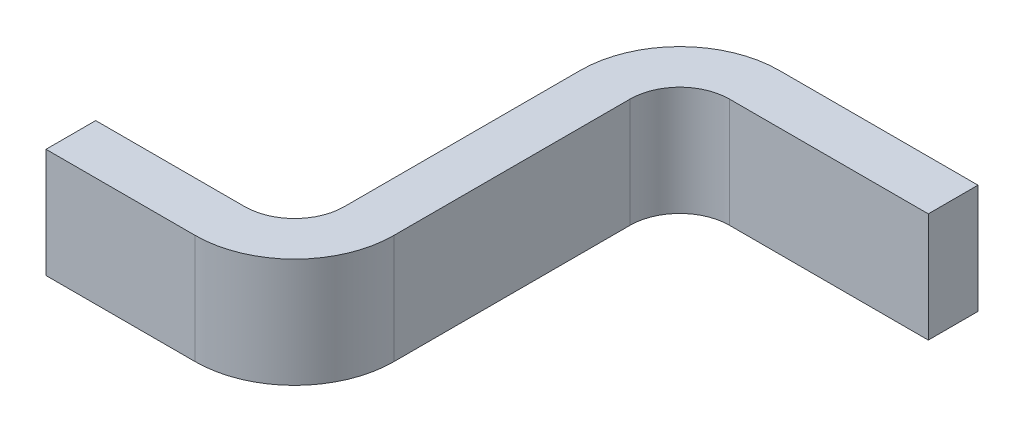
ISO-10303-21;
HEADER;
FILE_DESCRIPTION(('STEP AP214'),'2;1');
FILE_NAME('part.step','',(''),(''),'','','');
FILE_SCHEMA(('AUTOMOTIVE_DESIGN { 1 0 10303 214 1 1 1 1 }'));
ENDSEC;
DATA;
#1=APPLICATION_CONTEXT('core data for automotive mechanical design processes');
#2=APPLICATION_PROTOCOL_DEFINITION('international standard','automotive_design',2000,#1);
#3=PRODUCT_CONTEXT('',#1,'mechanical');
#4=PRODUCT('Part','Part','',(#3));
#5=PRODUCT_RELATED_PRODUCT_CATEGORY('part','',(#4));
#6=PRODUCT_DEFINITION_FORMATION('','',#4);
#7=PRODUCT_DEFINITION_CONTEXT('part definition',#1,'design');
#8=PRODUCT_DEFINITION('design','',#6,#7);
#9=PRODUCT_DEFINITION_SHAPE('','',#8);
#10=(LENGTH_UNIT() NAMED_UNIT(*) SI_UNIT(.MILLI.,.METRE.));
#11=(NAMED_UNIT(*) PLANE_ANGLE_UNIT() SI_UNIT($,.RADIAN.));
#12=(NAMED_UNIT(*) SI_UNIT($,.STERADIAN.) SOLID_ANGLE_UNIT());
#13=UNCERTAINTY_MEASURE_WITH_UNIT(LENGTH_MEASURE(1.E-05),#10,'distance_accuracy_value','');
#14=(GEOMETRIC_REPRESENTATION_CONTEXT(3) GLOBAL_UNCERTAINTY_ASSIGNED_CONTEXT((#13)) GLOBAL_UNIT_ASSIGNED_CONTEXT((#10,
#11,#12)) REPRESENTATION_CONTEXT('',''));
#15=CARTESIAN_POINT('',(0.,0.,0.));
#16=DIRECTION('',(0.,0.,1.));
#17=DIRECTION('',(1.,0.,0.));
#18=AXIS2_PLACEMENT_3D('',#15,#16,#17);
#19=CARTESIAN_POINT('',(3.9,1.86,0.675));
#20=DIRECTION('',(0.,-1.,0.));
#21=DIRECTION('',(0.,0.,-1.));
#22=AXIS2_PLACEMENT_3D('',#19,#20,#21);
#23=PLANE('',#22);
#24=CARTESIAN_POINT('',(3.8,1.86,0.675));
#25=DIRECTION('',(0.,-1.,0.));
#26=DIRECTION('',(0.,0.,-1.));
#27=AXIS2_PLACEMENT_3D('',#24,#25,#26);
#28=CIRCLE('',#27,0.1);
#29=CARTESIAN_POINT('',(3.9,1.86,0.675));
#30=VERTEX_POINT('',#29);
#31=CARTESIAN_POINT('',(3.8,1.86,0.775));
#32=VERTEX_POINT('',#31);
#33=EDGE_CURVE('E162',#30,#32,#28,.T.);
#34=ORIENTED_EDGE('',*,*,#33,.T.);
#35=DIRECTION('',(1.,0.,0.));
#36=VECTOR('',#35,1.);
#37=CARTESIAN_POINT('',(3.50000000000001,1.86,0.775));
#38=LINE('',#37,#36);
#39=CARTESIAN_POINT('',(3.50000000000001,1.86,0.775));
#40=VERTEX_POINT('',#39);
#41=EDGE_CURVE('E120',#32,#40,#38,.F.);
#42=ORIENTED_EDGE('',*,*,#41,.T.);
#43=DIRECTION('',(0.,0.,1.));
#44=VECTOR('',#43,1.);
#45=CARTESIAN_POINT('',(3.50000000000001,1.86,0.775));
#46=LINE('',#45,#44);
#47=CARTESIAN_POINT('',(3.50000000000001,1.86,0.875));
#48=VERTEX_POINT('',#47);
#49=EDGE_CURVE('E116',#48,#40,#46,.F.);
#50=ORIENTED_EDGE('',*,*,#49,.F.);
#51=DIRECTION('',(-1.,0.,0.));
#52=VECTOR('',#51,1.);
#53=CARTESIAN_POINT('',(3.50000000000001,1.86,0.875));
#54=LINE('',#53,#52);
#55=CARTESIAN_POINT('',(3.8,1.86,0.875));
#56=VERTEX_POINT('',#55);
#57=EDGE_CURVE('E111',#48,#56,#54,.F.);
#58=ORIENTED_EDGE('',*,*,#57,.T.);
#59=CARTESIAN_POINT('',(3.8,1.86,0.675));
#60=DIRECTION('',(0.,-1.,0.));
#61=DIRECTION('',(0.,0.,-1.));
#62=AXIS2_PLACEMENT_3D('',#59,#60,#61);
#63=CIRCLE('',#62,0.2);
#64=CARTESIAN_POINT('',(4.,1.86,0.675));
#65=VERTEX_POINT('',#64);
#66=EDGE_CURVE('E102',#65,#56,#63,.T.);
#67=ORIENTED_EDGE('',*,*,#66,.F.);
#68=DIRECTION('',(0.,0.,1.));
#69=VECTOR('',#68,1.);
#70=CARTESIAN_POINT('',(4.,1.86,0.675));
#71=LINE('',#70,#69);
#72=CARTESIAN_POINT('',(4.,1.86,0.2));
#73=VERTEX_POINT('',#72);
#74=EDGE_CURVE('E98',#65,#73,#71,.F.);
#75=ORIENTED_EDGE('',*,*,#74,.T.);
#76=CARTESIAN_POINT('',(4.1,1.86,0.2));
#77=DIRECTION('',(0.,1.,0.));
#78=DIRECTION('',(0.,0.,1.));
#79=AXIS2_PLACEMENT_3D('',#76,#77,#78);
#80=CIRCLE('',#79,0.1);
#81=CARTESIAN_POINT('',(4.1,1.86,0.1));
#82=VERTEX_POINT('',#81);
#83=EDGE_CURVE('E20',#73,#82,#80,.F.);
#84=ORIENTED_EDGE('',*,*,#83,.T.);
#85=DIRECTION('',(-1.,0.,0.));
#86=VECTOR('',#85,1.);
#87=CARTESIAN_POINT('',(4.1,1.86,0.1));
#88=LINE('',#87,#86);
#89=CARTESIAN_POINT('',(4.5,1.86,0.1));
#90=VERTEX_POINT('',#89);
#91=EDGE_CURVE('E145',#82,#90,#88,.F.);
#92=ORIENTED_EDGE('',*,*,#91,.T.);
#93=DIRECTION('',(0.,0.,1.));
#94=VECTOR('',#93,1.);
#95=CARTESIAN_POINT('',(4.5,1.86,0.));
#96=LINE('',#95,#94);
#97=CARTESIAN_POINT('',(4.5,1.86,0.));
#98=VERTEX_POINT('',#97);
#99=EDGE_CURVE('E139',#90,#98,#96,.F.);
#100=ORIENTED_EDGE('',*,*,#99,.T.);
#101=DIRECTION('',(1.,0.,0.));
#102=VECTOR('',#101,1.);
#103=CARTESIAN_POINT('',(4.1,1.86,0.));
#104=LINE('',#103,#102);
#105=CARTESIAN_POINT('',(4.1,1.86,0.));
#106=VERTEX_POINT('',#105);
#107=EDGE_CURVE('E132',#98,#106,#104,.F.);
#108=ORIENTED_EDGE('',*,*,#107,.T.);
#109=CARTESIAN_POINT('',(4.1,1.86,0.2));
#110=DIRECTION('',(0.,1.,0.));
#111=DIRECTION('',(0.,0.,1.));
#112=AXIS2_PLACEMENT_3D('',#109,#110,#111);
#113=CIRCLE('',#112,0.2);
#114=CARTESIAN_POINT('',(3.9,1.86,0.2));
#115=VERTEX_POINT('',#114);
#116=EDGE_CURVE('E135',#115,#106,#113,.F.);
#117=ORIENTED_EDGE('',*,*,#116,.F.);
#118=DIRECTION('',(0.,0.,-1.));
#119=VECTOR('',#118,1.);
#120=CARTESIAN_POINT('',(3.9,1.86,0.675));
#121=LINE('',#120,#119);
#122=EDGE_CURVE('E128',#115,#30,#121,.F.);
#123=ORIENTED_EDGE('',*,*,#122,.T.);
#124=EDGE_LOOP('',(#34,#42,#50,#58,#67,#75,#84,#92,#100,#108,#117,#123));
#125=FACE_BOUND('',#124,.T.);
#126=ADVANCED_FACE('F17',(#125),#23,.F.);
#127=CARTESIAN_POINT('',(4.1,1.86,0.2));
#128=DIRECTION('',(0.,1.,0.));
#129=DIRECTION('',(0.,0.,1.));
#130=AXIS2_PLACEMENT_3D('',#127,#128,#129);
#131=CYLINDRICAL_SURFACE('',#130,0.1);
#132=DIRECTION('',(0.,1.,0.));
#133=VECTOR('',#132,1.);
#134=CARTESIAN_POINT('',(4.,1.86,0.2));
#135=LINE('',#134,#133);
#136=CARTESIAN_POINT('',(4.,1.64,0.2));
#137=VERTEX_POINT('',#136);
#138=EDGE_CURVE('E91',#73,#137,#135,.F.);
#139=ORIENTED_EDGE('',*,*,#138,.T.);
#140=CARTESIAN_POINT('',(4.1,1.64,0.2));
#141=DIRECTION('',(0.,1.,0.));
#142=DIRECTION('',(0.,0.,1.));
#143=AXIS2_PLACEMENT_3D('',#140,#141,#142);
#144=CIRCLE('',#143,0.1);
#145=CARTESIAN_POINT('',(4.1,1.64,0.1));
#146=VERTEX_POINT('',#145);
#147=EDGE_CURVE('E103',#137,#146,#144,.F.);
#148=ORIENTED_EDGE('',*,*,#147,.T.);
#149=DIRECTION('',(0.,1.,0.));
#150=VECTOR('',#149,1.);
#151=CARTESIAN_POINT('',(4.1,1.86,0.1));
#152=LINE('',#151,#150);
#153=EDGE_CURVE('E92',#146,#82,#152,.T.);
#154=ORIENTED_EDGE('',*,*,#153,.T.);
#155=ORIENTED_EDGE('',*,*,#83,.F.);
#156=EDGE_LOOP('',(#139,#148,#154,#155));
#157=FACE_BOUND('',#156,.T.);
#158=ADVANCED_FACE('F89',(#157),#131,.F.);
#159=CARTESIAN_POINT('',(4.1,1.86,0.1));
#160=DIRECTION('',(0.,0.,-1.));
#161=DIRECTION('',(-1.,0.,0.));
#162=AXIS2_PLACEMENT_3D('',#159,#160,#161);
#163=PLANE('',#162);
#164=ORIENTED_EDGE('',*,*,#153,.F.);
#165=DIRECTION('',(1.,0.,0.));
#166=VECTOR('',#165,1.);
#167=CARTESIAN_POINT('',(4.,1.64,0.1));
#168=LINE('',#167,#166);
#169=CARTESIAN_POINT('',(4.5,1.64,0.1));
#170=VERTEX_POINT('',#169);
#171=EDGE_CURVE('E105',#146,#170,#168,.T.);
#172=ORIENTED_EDGE('',*,*,#171,.T.);
#173=DIRECTION('',(0.,1.,0.));
#174=VECTOR('',#173,1.);
#175=CARTESIAN_POINT('',(4.5,1.64,0.1));
#176=LINE('',#175,#174);
#177=EDGE_CURVE('E142',#170,#90,#176,.T.);
#178=ORIENTED_EDGE('',*,*,#177,.T.);
#179=ORIENTED_EDGE('',*,*,#91,.F.);
#180=EDGE_LOOP('',(#164,#172,#178,#179));
#181=FACE_BOUND('',#180,.T.);
#182=ADVANCED_FACE('F187',(#181),#163,.F.);
#183=CARTESIAN_POINT('',(4.5,1.64,0.));
#184=DIRECTION('',(-1.,0.,0.));
#185=DIRECTION('',(0.,0.,1.));
#186=AXIS2_PLACEMENT_3D('',#183,#184,#185);
#187=PLANE('',#186);
#188=ORIENTED_EDGE('',*,*,#177,.F.);
#189=DIRECTION('',(0.,0.,1.));
#190=VECTOR('',#189,1.);
#191=CARTESIAN_POINT('',(4.5,1.64,0.675));
#192=LINE('',#191,#190);
#193=CARTESIAN_POINT('',(4.5,1.64,0.));
#194=VERTEX_POINT('',#193);
#195=EDGE_CURVE('E176',#170,#194,#192,.F.);
#196=ORIENTED_EDGE('',*,*,#195,.T.);
#197=DIRECTION('',(0.,1.,0.));
#198=VECTOR('',#197,1.);
#199=CARTESIAN_POINT('',(4.5,1.64,0.));
#200=LINE('',#199,#198);
#201=EDGE_CURVE('E136',#194,#98,#200,.T.);
#202=ORIENTED_EDGE('',*,*,#201,.T.);
#203=ORIENTED_EDGE('',*,*,#99,.F.);
#204=EDGE_LOOP('',(#188,#196,#202,#203));
#205=FACE_BOUND('',#204,.T.);
#206=ADVANCED_FACE('F192',(#205),#187,.F.);
#207=CARTESIAN_POINT('',(4.1,1.64,0.));
#208=DIRECTION('',(0.,0.,1.));
#209=DIRECTION('',(1.,0.,0.));
#210=AXIS2_PLACEMENT_3D('',#207,#208,#209);
#211=PLANE('',#210);
#212=DIRECTION('',(0.,1.,0.));
#213=VECTOR('',#212,1.);
#214=CARTESIAN_POINT('',(4.1,1.64,0.));
#215=LINE('',#214,#213);
#216=CARTESIAN_POINT('',(4.1,1.64,0.));
#217=VERTEX_POINT('',#216);
#218=EDGE_CURVE('E163',#106,#217,#215,.F.);
#219=ORIENTED_EDGE('',*,*,#218,.F.);
#220=ORIENTED_EDGE('',*,*,#107,.F.);
#221=ORIENTED_EDGE('',*,*,#201,.F.);
#222=DIRECTION('',(1.,0.,0.));
#223=VECTOR('',#222,1.);
#224=CARTESIAN_POINT('',(4.,1.64,0.));
#225=LINE('',#224,#223);
#226=EDGE_CURVE('E159',#194,#217,#225,.F.);
#227=ORIENTED_EDGE('',*,*,#226,.T.);
#228=EDGE_LOOP('',(#219,#220,#221,#227));
#229=FACE_BOUND('',#228,.T.);
#230=ADVANCED_FACE('F264',(#229),#211,.F.);
#231=CARTESIAN_POINT('',(4.1,1.64,0.2));
#232=DIRECTION('',(0.,1.,0.));
#233=DIRECTION('',(0.,0.,1.));
#234=AXIS2_PLACEMENT_3D('',#231,#232,#233);
#235=CYLINDRICAL_SURFACE('',#234,0.2);
#236=ORIENTED_EDGE('',*,*,#116,.T.);
#237=ORIENTED_EDGE('',*,*,#218,.T.);
#238=CARTESIAN_POINT('',(4.1,1.64,0.2));
#239=DIRECTION('',(0.,1.,0.));
#240=DIRECTION('',(0.,0.,1.));
#241=AXIS2_PLACEMENT_3D('',#238,#239,#240);
#242=CIRCLE('',#241,0.2);
#243=CARTESIAN_POINT('',(3.90000000000001,1.64,0.2));
#244=VERTEX_POINT('',#243);
#245=EDGE_CURVE('E157',#217,#244,#242,.T.);
#246=ORIENTED_EDGE('',*,*,#245,.T.);
#247=DIRECTION('',(0.,1.,0.));
#248=VECTOR('',#247,1.);
#249=CARTESIAN_POINT('',(3.90000000000001,1.64,0.2));
#250=LINE('',#249,#248);
#251=EDGE_CURVE('E131',#244,#115,#250,.T.);
#252=ORIENTED_EDGE('',*,*,#251,.T.);
#253=EDGE_LOOP('',(#236,#237,#246,#252));
#254=FACE_BOUND('',#253,.T.);
#255=ADVANCED_FACE('F266',(#254),#235,.T.);
#256=CARTESIAN_POINT('',(3.90000000000001,1.64,0.675));
#257=DIRECTION('',(1.,0.,0.));
#258=DIRECTION('',(0.,0.,-1.));
#259=AXIS2_PLACEMENT_3D('',#256,#257,#258);
#260=PLANE('',#259);
#261=DIRECTION('',(0.,-1.,0.));
#262=VECTOR('',#261,1.);
#263=CARTESIAN_POINT('',(3.90000000000001,1.64,0.675));
#264=LINE('',#263,#262);
#265=CARTESIAN_POINT('',(3.90000000000001,1.64,0.675));
#266=VERTEX_POINT('',#265);
#267=EDGE_CURVE('E130',#266,#30,#264,.F.);
#268=ORIENTED_EDGE('',*,*,#267,.T.);
#269=ORIENTED_EDGE('',*,*,#122,.F.);
#270=ORIENTED_EDGE('',*,*,#251,.F.);
#271=DIRECTION('',(0.,0.,1.));
#272=VECTOR('',#271,1.);
#273=CARTESIAN_POINT('',(3.90000000000001,1.64,0.675));
#274=LINE('',#273,#272);
#275=EDGE_CURVE('E156',#244,#266,#274,.T.);
#276=ORIENTED_EDGE('',*,*,#275,.T.);
#277=EDGE_LOOP('',(#268,#269,#270,#276));
#278=FACE_BOUND('',#277,.T.);
#279=ADVANCED_FACE('F231',(#278),#260,.F.);
#280=CARTESIAN_POINT('',(3.8,1.64,0.675));
#281=DIRECTION('',(0.,-1.,0.));
#282=DIRECTION('',(0.,0.,-1.));
#283=AXIS2_PLACEMENT_3D('',#280,#281,#282);
#284=CYLINDRICAL_SURFACE('',#283,0.1);
#285=DIRECTION('',(0.,1.,0.));
#286=VECTOR('',#285,1.);
#287=CARTESIAN_POINT('',(3.8,1.64,0.775));
#288=LINE('',#287,#286);
#289=CARTESIAN_POINT('',(3.8,1.64,0.775));
#290=VERTEX_POINT('',#289);
#291=EDGE_CURVE('E125',#290,#32,#288,.T.);
#292=ORIENTED_EDGE('',*,*,#291,.T.);
#293=ORIENTED_EDGE('',*,*,#33,.F.);
#294=ORIENTED_EDGE('',*,*,#267,.F.);
#295=CARTESIAN_POINT('',(3.8,1.64,0.675));
#296=DIRECTION('',(0.,-1.,0.));
#297=DIRECTION('',(0.,0.,-1.));
#298=AXIS2_PLACEMENT_3D('',#295,#296,#297);
#299=CIRCLE('',#298,0.1);
#300=EDGE_CURVE('E152',#266,#290,#299,.T.);
#301=ORIENTED_EDGE('',*,*,#300,.T.);
#302=EDGE_LOOP('',(#292,#293,#294,#301));
#303=FACE_BOUND('',#302,.T.);
#304=ADVANCED_FACE('F235',(#303),#284,.F.);
#305=CARTESIAN_POINT('',(3.50000000000001,1.64,0.775));
#306=DIRECTION('',(0.,0.,1.));
#307=DIRECTION('',(1.,0.,0.));
#308=AXIS2_PLACEMENT_3D('',#305,#306,#307);
#309=PLANE('',#308);
#310=DIRECTION('',(0.,1.,0.));
#311=VECTOR('',#310,1.);
#312=CARTESIAN_POINT('',(3.50000000000001,1.64,0.775));
#313=LINE('',#312,#311);
#314=CARTESIAN_POINT('',(3.50000000000001,1.64,0.775));
#315=VERTEX_POINT('',#314);
#316=EDGE_CURVE('E119',#40,#315,#313,.F.);
#317=ORIENTED_EDGE('',*,*,#316,.F.);
#318=ORIENTED_EDGE('',*,*,#41,.F.);
#319=ORIENTED_EDGE('',*,*,#291,.F.);
#320=DIRECTION('',(1.,0.,0.));
#321=VECTOR('',#320,1.);
#322=CARTESIAN_POINT('',(4.,1.64,0.775));
#323=LINE('',#322,#321);
#324=EDGE_CURVE('E155',#290,#315,#323,.F.);
#325=ORIENTED_EDGE('',*,*,#324,.T.);
#326=EDGE_LOOP('',(#317,#318,#319,#325));
#327=FACE_BOUND('',#326,.T.);
#328=ADVANCED_FACE('F259',(#327),#309,.F.);
#329=CARTESIAN_POINT('',(3.50000000000001,1.64,0.775));
#330=DIRECTION('',(-1.,0.,0.));
#331=DIRECTION('',(0.,0.,1.));
#332=AXIS2_PLACEMENT_3D('',#329,#330,#331);
#333=PLANE('',#332);
#334=DIRECTION('',(0.,0.,1.));
#335=VECTOR('',#334,1.);
#336=CARTESIAN_POINT('',(3.50000000000001,1.64,0.675));
#337=LINE('',#336,#335);
#338=CARTESIAN_POINT('',(3.50000000000001,1.64,0.875));
#339=VERTEX_POINT('',#338);
#340=EDGE_CURVE('E217',#315,#339,#337,.T.);
#341=ORIENTED_EDGE('',*,*,#340,.T.);
#342=DIRECTION('',(0.,1.,0.));
#343=VECTOR('',#342,1.);
#344=CARTESIAN_POINT('',(3.50000000000001,1.86,0.875));
#345=LINE('',#344,#343);
#346=EDGE_CURVE('E113',#339,#48,#345,.T.);
#347=ORIENTED_EDGE('',*,*,#346,.T.);
#348=ORIENTED_EDGE('',*,*,#49,.T.);
#349=ORIENTED_EDGE('',*,*,#316,.T.);
#350=EDGE_LOOP('',(#341,#347,#348,#349));
#351=FACE_BOUND('',#350,.T.);
#352=ADVANCED_FACE('F255',(#351),#333,.T.);
#353=CARTESIAN_POINT('',(3.50000000000001,1.86,0.875));
#354=DIRECTION('',(0.,0.,-1.));
#355=DIRECTION('',(-1.,0.,0.));
#356=AXIS2_PLACEMENT_3D('',#353,#354,#355);
#357=PLANE('',#356);
#358=ORIENTED_EDGE('',*,*,#346,.F.);
#359=DIRECTION('',(1.,0.,0.));
#360=VECTOR('',#359,1.);
#361=CARTESIAN_POINT('',(4.,1.64,0.875));
#362=LINE('',#361,#360);
#363=CARTESIAN_POINT('',(3.8,1.64,0.875));
#364=VERTEX_POINT('',#363);
#365=EDGE_CURVE('E151',#339,#364,#362,.T.);
#366=ORIENTED_EDGE('',*,*,#365,.T.);
#367=DIRECTION('',(0.,-1.,0.));
#368=VECTOR('',#367,1.);
#369=CARTESIAN_POINT('',(3.8,1.86,0.875));
#370=LINE('',#369,#368);
#371=EDGE_CURVE('E99',#56,#364,#370,.T.);
#372=ORIENTED_EDGE('',*,*,#371,.F.);
#373=ORIENTED_EDGE('',*,*,#57,.F.);
#374=EDGE_LOOP('',(#358,#366,#372,#373));
#375=FACE_BOUND('',#374,.T.);
#376=ADVANCED_FACE('F251',(#375),#357,.F.);
#377=CARTESIAN_POINT('',(3.8,1.86,0.675));
#378=DIRECTION('',(0.,-1.,0.));
#379=DIRECTION('',(0.,0.,-1.));
#380=AXIS2_PLACEMENT_3D('',#377,#378,#379);
#381=CYLINDRICAL_SURFACE('',#380,0.2);
#382=CARTESIAN_POINT('',(3.8,1.64,0.675));
#383=DIRECTION('',(0.,-1.,0.));
#384=DIRECTION('',(0.,0.,-1.));
#385=AXIS2_PLACEMENT_3D('',#382,#383,#384);
#386=CIRCLE('',#385,0.2);
#387=CARTESIAN_POINT('',(4.,1.64,0.675));
#388=VERTEX_POINT('',#387);
#389=EDGE_CURVE('E26',#364,#388,#386,.F.);
#390=ORIENTED_EDGE('',*,*,#389,.T.);
#391=DIRECTION('',(0.,1.,0.));
#392=VECTOR('',#391,1.);
#393=CARTESIAN_POINT('',(4.,1.86,0.675));
#394=LINE('',#393,#392);
#395=EDGE_CURVE('E34',#388,#65,#394,.T.);
#396=ORIENTED_EDGE('',*,*,#395,.T.);
#397=ORIENTED_EDGE('',*,*,#66,.T.);
#398=ORIENTED_EDGE('',*,*,#371,.T.);
#399=EDGE_LOOP('',(#390,#396,#397,#398));
#400=FACE_BOUND('',#399,.T.);
#401=ADVANCED_FACE('F280',(#400),#381,.T.);
#402=CARTESIAN_POINT('',(4.,1.86,0.675));
#403=DIRECTION('',(-1.,0.,0.));
#404=DIRECTION('',(0.,0.,1.));
#405=AXIS2_PLACEMENT_3D('',#402,#403,#404);
#406=PLANE('',#405);
#407=ORIENTED_EDGE('',*,*,#395,.F.);
#408=DIRECTION('',(0.,0.,1.));
#409=VECTOR('',#408,1.);
#410=CARTESIAN_POINT('',(4.,1.64,0.675));
#411=LINE('',#410,#409);
#412=EDGE_CURVE('E11',#388,#137,#411,.F.);
#413=ORIENTED_EDGE('',*,*,#412,.T.);
#414=ORIENTED_EDGE('',*,*,#138,.F.);
#415=ORIENTED_EDGE('',*,*,#74,.F.);
#416=EDGE_LOOP('',(#407,#413,#414,#415));
#417=FACE_BOUND('',#416,.T.);
#418=ADVANCED_FACE('F97',(#417),#406,.F.);
#419=CARTESIAN_POINT('',(4.,1.64,0.675));
#420=DIRECTION('',(0.,1.,0.));
#421=DIRECTION('',(0.,0.,1.));
#422=AXIS2_PLACEMENT_3D('',#419,#420,#421);
#423=PLANE('',#422);
#424=ORIENTED_EDGE('',*,*,#389,.F.);
#425=ORIENTED_EDGE('',*,*,#365,.F.);
#426=ORIENTED_EDGE('',*,*,#340,.F.);
#427=ORIENTED_EDGE('',*,*,#324,.F.);
#428=ORIENTED_EDGE('',*,*,#300,.F.);
#429=ORIENTED_EDGE('',*,*,#275,.F.);
#430=ORIENTED_EDGE('',*,*,#245,.F.);
#431=ORIENTED_EDGE('',*,*,#226,.F.);
#432=ORIENTED_EDGE('',*,*,#195,.F.);
#433=ORIENTED_EDGE('',*,*,#171,.F.);
#434=ORIENTED_EDGE('',*,*,#147,.F.);
#435=ORIENTED_EDGE('',*,*,#412,.F.);
#436=EDGE_LOOP('',(#424,#425,#426,#427,#428,#429,#430,#431,#432,#433,#434,#435));
#437=FACE_BOUND('',#436,.T.);
#438=ADVANCED_FACE('F197',(#437),#423,.F.);
#439=CLOSED_SHELL('',(#126,#158,#182,#206,#230,#255,#279,#304,#328,#352,#376,#401,#418,#438));
#440=MANIFOLD_SOLID_BREP('B1',#439);
#441=ADVANCED_BREP_SHAPE_REPRESENTATION('',(#18,#440),#14);
#442=SHAPE_DEFINITION_REPRESENTATION(#9,#441);
ENDSEC;
END-ISO-10303-21;
